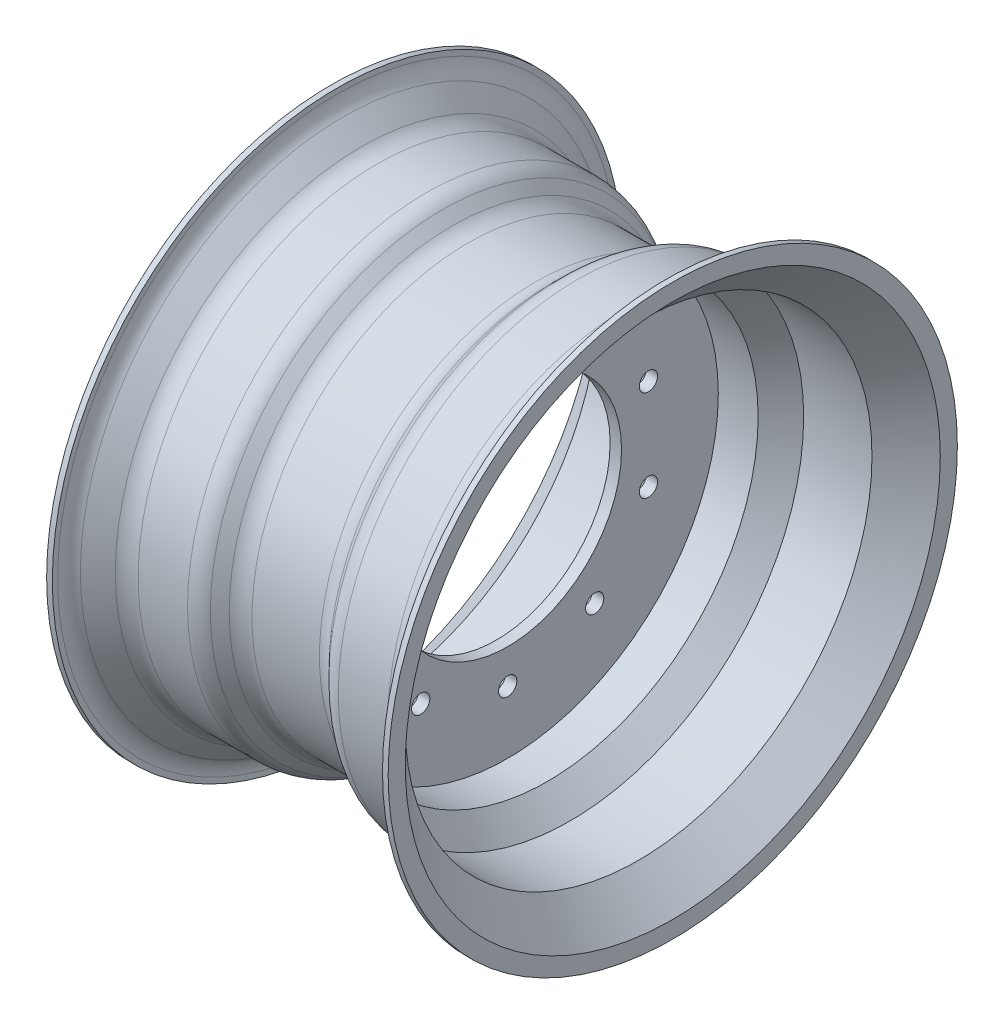
ISO-10303-21;
HEADER;
FILE_DESCRIPTION(('STEP AP214'),'2;1');
FILE_NAME('part.step','',(''),(''),'','','');
FILE_SCHEMA(('AUTOMOTIVE_DESIGN { 1 0 10303 214 1 1 1 1 }'));
ENDSEC;
DATA;
#1=APPLICATION_CONTEXT('core data for automotive mechanical design processes');
#2=APPLICATION_PROTOCOL_DEFINITION('international standard','automotive_design',2000,#1);
#3=PRODUCT_CONTEXT('',#1,'mechanical');
#4=PRODUCT('Part','Part','',(#3));
#5=PRODUCT_RELATED_PRODUCT_CATEGORY('part','',(#4));
#6=PRODUCT_DEFINITION_FORMATION('','',#4);
#7=PRODUCT_DEFINITION_CONTEXT('part definition',#1,'design');
#8=PRODUCT_DEFINITION('design','',#6,#7);
#9=PRODUCT_DEFINITION_SHAPE('','',#8);
#10=(LENGTH_UNIT() NAMED_UNIT(*) SI_UNIT(.MILLI.,.METRE.));
#11=(NAMED_UNIT(*) PLANE_ANGLE_UNIT() SI_UNIT($,.RADIAN.));
#12=(NAMED_UNIT(*) SI_UNIT($,.STERADIAN.) SOLID_ANGLE_UNIT());
#13=UNCERTAINTY_MEASURE_WITH_UNIT(LENGTH_MEASURE(1.E-05),#10,'distance_accuracy_value','');
#14=(GEOMETRIC_REPRESENTATION_CONTEXT(3) GLOBAL_UNCERTAINTY_ASSIGNED_CONTEXT((#13)) GLOBAL_UNIT_ASSIGNED_CONTEXT((#10,
#11,#12)) REPRESENTATION_CONTEXT('',''));
#15=CARTESIAN_POINT('',(0.,0.,0.));
#16=DIRECTION('',(0.,0.,1.));
#17=DIRECTION('',(1.,0.,0.));
#18=AXIS2_PLACEMENT_3D('',#15,#16,#17);
#19=CARTESIAN_POINT('',(0.,0.,0.));
#20=DIRECTION('',(1.,0.,0.));
#21=DIRECTION('',(0.,0.,-1.));
#22=AXIS2_PLACEMENT_3D('',#19,#20,#21);
#23=CYLINDRICAL_SURFACE('',#22,250.);
#24=CARTESIAN_POINT('',(-150.,0.,0.));
#25=DIRECTION('',(1.,0.,0.));
#26=DIRECTION('',(0.,0.,-1.));
#27=AXIS2_PLACEMENT_3D('',#24,#25,#26);
#28=CIRCLE('',#27,250.);
#29=CARTESIAN_POINT('',(-150.,0.,-250.));
#30=VERTEX_POINT('',#29);
#31=EDGE_CURVE('E169',#30,#30,#28,.T.);
#32=ORIENTED_EDGE('',*,*,#31,.T.);
#33=EDGE_LOOP('',(#32));
#34=FACE_BOUND('',#33,.T.);
#35=CARTESIAN_POINT('',(-145.,0.,0.));
#36=DIRECTION('',(1.,0.,0.));
#37=DIRECTION('',(0.,0.,-1.));
#38=AXIS2_PLACEMENT_3D('',#35,#36,#37);
#39=CIRCLE('',#38,250.);
#40=CARTESIAN_POINT('',(-145.,0.,-250.));
#41=VERTEX_POINT('',#40);
#42=EDGE_CURVE('E109',#41,#41,#39,.T.);
#43=ORIENTED_EDGE('',*,*,#42,.F.);
#44=EDGE_LOOP('',(#43));
#45=FACE_BOUND('',#44,.T.);
#46=ADVANCED_FACE('F37',(#34,#45),#23,.T.);
#47=CARTESIAN_POINT('',(-145.,250.,0.));
#48=DIRECTION('',(1.,0.,0.));
#49=DIRECTION('',(0.,0.,-1.));
#50=AXIS2_PLACEMENT_3D('',#47,#48,#49);
#51=PLANE('',#50);
#52=CARTESIAN_POINT('',(-145.,0.,0.));
#53=DIRECTION('',(1.,0.,0.));
#54=DIRECTION('',(0.,0.,-1.));
#55=AXIS2_PLACEMENT_3D('',#52,#53,#54);
#56=CIRCLE('',#55,245.355339059327);
#57=CARTESIAN_POINT('',(-145.,0.,-245.355339059327));
#58=VERTEX_POINT('',#57);
#59=EDGE_CURVE('E10',#58,#58,#56,.F.);
#60=ORIENTED_EDGE('',*,*,#59,.T.);
#61=EDGE_LOOP('',(#60));
#62=FACE_BOUND('',#61,.T.);
#63=ORIENTED_EDGE('',*,*,#42,.T.);
#64=EDGE_LOOP('',(#63));
#65=FACE_BOUND('',#64,.T.);
#66=ADVANCED_FACE('F324',(#62,#65),#51,.T.);
#67=CARTESIAN_POINT('',(-117.928932188135,0.,0.));
#68=DIRECTION('',(-1.,0.,0.));
#69=DIRECTION('',(0.,0.,1.));
#70=AXIS2_PLACEMENT_3D('',#67,#68,#69);
#71=CONICAL_SURFACE('',#70,210.,0.785398163397448);
#72=CARTESIAN_POINT('',(-123.786796564404,0.,0.));
#73=DIRECTION('',(-1.,0.,0.));
#74=DIRECTION('',(0.,0.,1.));
#75=AXIS2_PLACEMENT_3D('',#72,#73,#74);
#76=CIRCLE('',#75,215.857864376269);
#77=CARTESIAN_POINT('',(-123.786796564404,0.,215.857864376269));
#78=VERTEX_POINT('',#77);
#79=EDGE_CURVE('E45',#78,#78,#76,.T.);
#80=ORIENTED_EDGE('',*,*,#79,.T.);
#81=EDGE_LOOP('',(#80));
#82=FACE_BOUND('',#81,.T.);
#83=CARTESIAN_POINT('',(-139.142135623731,0.,0.));
#84=DIRECTION('',(-1.,0.,0.));
#85=DIRECTION('',(0.,0.,1.));
#86=AXIS2_PLACEMENT_3D('',#83,#84,#85);
#87=CIRCLE('',#86,231.213203435596);
#88=CARTESIAN_POINT('',(-139.142135623731,0.,231.213203435596));
#89=VERTEX_POINT('',#88);
#90=EDGE_CURVE('E50',#89,#89,#87,.F.);
#91=ORIENTED_EDGE('',*,*,#90,.T.);
#92=EDGE_LOOP('',(#91));
#93=FACE_BOUND('',#92,.T.);
#94=ADVANCED_FACE('F329',(#82,#93),#71,.T.);
#95=CARTESIAN_POINT('',(0.,0.,0.));
#96=DIRECTION('',(1.,0.,0.));
#97=DIRECTION('',(0.,0.,-1.));
#98=AXIS2_PLACEMENT_3D('',#95,#96,#97);
#99=CYLINDRICAL_SURFACE('',#98,210.);
#100=CARTESIAN_POINT('',(-66.2132034355965,0.,0.));
#101=DIRECTION('',(-1.,0.,0.));
#102=DIRECTION('',(0.,0.,1.));
#103=AXIS2_PLACEMENT_3D('',#100,#101,#102);
#104=CIRCLE('',#103,210.);
#105=CARTESIAN_POINT('',(-66.2132034355965,0.,210.));
#106=VERTEX_POINT('',#105);
#107=EDGE_CURVE('E55',#106,#106,#104,.T.);
#108=ORIENTED_EDGE('',*,*,#107,.T.);
#109=EDGE_LOOP('',(#108));
#110=FACE_BOUND('',#109,.T.);
#111=CARTESIAN_POINT('',(-109.644660940673,0.,0.));
#112=DIRECTION('',(1.,0.,0.));
#113=DIRECTION('',(0.,0.,-1.));
#114=AXIS2_PLACEMENT_3D('',#111,#112,#113);
#115=CIRCLE('',#114,210.);
#116=CARTESIAN_POINT('',(-109.644660940673,0.,-210.));
#117=VERTEX_POINT('',#116);
#118=EDGE_CURVE('E61',#117,#117,#115,.T.);
#119=ORIENTED_EDGE('',*,*,#118,.T.);
#120=EDGE_LOOP('',(#119));
#121=FACE_BOUND('',#120,.T.);
#122=ADVANCED_FACE('F334',(#110,#121),#99,.T.);
#123=CARTESIAN_POINT('',(-37.9289321881345,0.,0.));
#124=DIRECTION('',(-1.,0.,0.));
#125=DIRECTION('',(0.,0.,1.));
#126=AXIS2_PLACEMENT_3D('',#123,#124,#125);
#127=CONICAL_SURFACE('',#126,190.,0.785398163397448);
#128=CARTESIAN_POINT('',(-43.7867965644036,0.,0.));
#129=DIRECTION('',(-1.,0.,0.));
#130=DIRECTION('',(0.,0.,1.));
#131=AXIS2_PLACEMENT_3D('',#128,#129,#130);
#132=CIRCLE('',#131,195.857864376269);
#133=CARTESIAN_POINT('',(-43.7867965644036,0.,195.857864376269));
#134=VERTEX_POINT('',#133);
#135=EDGE_CURVE('E65',#134,#134,#132,.T.);
#136=ORIENTED_EDGE('',*,*,#135,.T.);
#137=EDGE_LOOP('',(#136));
#138=FACE_BOUND('',#137,.T.);
#139=CARTESIAN_POINT('',(-52.0710678118656,0.,0.));
#140=DIRECTION('',(1.,0.,0.));
#141=DIRECTION('',(0.,0.,-1.));
#142=AXIS2_PLACEMENT_3D('',#139,#140,#141);
#143=CIRCLE('',#142,204.142135623731);
#144=CARTESIAN_POINT('',(-52.0710678118656,0.,-204.142135623731));
#145=VERTEX_POINT('',#144);
#146=EDGE_CURVE('E69',#145,#145,#143,.T.);
#147=ORIENTED_EDGE('',*,*,#146,.T.);
#148=EDGE_LOOP('',(#147));
#149=FACE_BOUND('',#148,.T.);
#150=ADVANCED_FACE('F372',(#138,#149),#127,.T.);
#151=CARTESIAN_POINT('',(0.,0.,0.));
#152=DIRECTION('',(1.,0.,0.));
#153=DIRECTION('',(0.,0.,-1.));
#154=AXIS2_PLACEMENT_3D('',#151,#152,#153);
#155=CYLINDRICAL_SURFACE('',#154,190.);
#156=CARTESIAN_POINT('',(29.6446609406726,0.,0.));
#157=DIRECTION('',(1.,0.,0.));
#158=DIRECTION('',(0.,0.,-1.));
#159=AXIS2_PLACEMENT_3D('',#156,#157,#158);
#160=CIRCLE('',#159,190.);
#161=CARTESIAN_POINT('',(29.6446609406726,0.,-190.));
#162=VERTEX_POINT('',#161);
#163=EDGE_CURVE('E73',#162,#162,#160,.F.);
#164=ORIENTED_EDGE('',*,*,#163,.T.);
#165=EDGE_LOOP('',(#164));
#166=FACE_BOUND('',#165,.T.);
#167=CARTESIAN_POINT('',(-29.6446609406726,0.,0.));
#168=DIRECTION('',(1.,0.,0.));
#169=DIRECTION('',(0.,0.,-1.));
#170=AXIS2_PLACEMENT_3D('',#167,#168,#169);
#171=CIRCLE('',#170,190.);
#172=CARTESIAN_POINT('',(-29.6446609406726,0.,-190.));
#173=VERTEX_POINT('',#172);
#174=EDGE_CURVE('E77',#173,#173,#171,.T.);
#175=ORIENTED_EDGE('',*,*,#174,.T.);
#176=EDGE_LOOP('',(#175));
#177=FACE_BOUND('',#176,.T.);
#178=ADVANCED_FACE('F377',(#166,#177),#155,.T.);
#179=CARTESIAN_POINT('',(57.9289321881346,0.,0.));
#180=DIRECTION('',(1.,0.,0.));
#181=DIRECTION('',(0.,0.,-1.));
#182=AXIS2_PLACEMENT_3D('',#179,#180,#181);
#183=CONICAL_SURFACE('',#182,210.,0.785398163397448);
#184=CARTESIAN_POINT('',(52.0710678118656,0.,0.));
#185=DIRECTION('',(-1.,0.,0.));
#186=DIRECTION('',(0.,0.,1.));
#187=AXIS2_PLACEMENT_3D('',#184,#185,#186);
#188=CIRCLE('',#187,204.142135623731);
#189=CARTESIAN_POINT('',(52.0710678118656,0.,204.142135623731));
#190=VERTEX_POINT('',#189);
#191=EDGE_CURVE('E81',#190,#190,#188,.T.);
#192=ORIENTED_EDGE('',*,*,#191,.T.);
#193=EDGE_LOOP('',(#192));
#194=FACE_BOUND('',#193,.T.);
#195=CARTESIAN_POINT('',(43.7867965644036,0.,0.));
#196=DIRECTION('',(1.,0.,0.));
#197=DIRECTION('',(0.,0.,-1.));
#198=AXIS2_PLACEMENT_3D('',#195,#196,#197);
#199=CIRCLE('',#198,195.857864376269);
#200=CARTESIAN_POINT('',(43.7867965644036,0.,-195.857864376269));
#201=VERTEX_POINT('',#200);
#202=EDGE_CURVE('E85',#201,#201,#199,.T.);
#203=ORIENTED_EDGE('',*,*,#202,.T.);
#204=EDGE_LOOP('',(#203));
#205=FACE_BOUND('',#204,.T.);
#206=ADVANCED_FACE('F383',(#194,#205),#183,.T.);
#207=CARTESIAN_POINT('',(0.,0.,0.));
#208=DIRECTION('',(1.,0.,0.));
#209=DIRECTION('',(0.,0.,-1.));
#210=AXIS2_PLACEMENT_3D('',#207,#208,#209);
#211=CYLINDRICAL_SURFACE('',#210,210.);
#212=CARTESIAN_POINT('',(109.644660940673,0.,0.));
#213=DIRECTION('',(1.,0.,0.));
#214=DIRECTION('',(0.,0.,-1.));
#215=AXIS2_PLACEMENT_3D('',#212,#213,#214);
#216=CIRCLE('',#215,210.);
#217=CARTESIAN_POINT('',(109.644660940673,0.,-210.));
#218=VERTEX_POINT('',#217);
#219=EDGE_CURVE('E89',#218,#218,#216,.F.);
#220=ORIENTED_EDGE('',*,*,#219,.T.);
#221=EDGE_LOOP('',(#220));
#222=FACE_BOUND('',#221,.T.);
#223=CARTESIAN_POINT('',(66.2132034355965,0.,0.));
#224=DIRECTION('',(-1.,0.,0.));
#225=DIRECTION('',(0.,0.,1.));
#226=AXIS2_PLACEMENT_3D('',#223,#224,#225);
#227=CIRCLE('',#226,210.);
#228=CARTESIAN_POINT('',(66.2132034355965,0.,210.));
#229=VERTEX_POINT('',#228);
#230=EDGE_CURVE('E93',#229,#229,#227,.F.);
#231=ORIENTED_EDGE('',*,*,#230,.T.);
#232=EDGE_LOOP('',(#231));
#233=FACE_BOUND('',#232,.T.);
#234=ADVANCED_FACE('F387',(#222,#233),#211,.T.);
#235=CARTESIAN_POINT('',(145.,0.,0.));
#236=DIRECTION('',(1.,0.,0.));
#237=DIRECTION('',(0.,0.,-1.));
#238=AXIS2_PLACEMENT_3D('',#235,#236,#237);
#239=CONICAL_SURFACE('',#238,237.071067811865,0.785398163397448);
#240=CARTESIAN_POINT('',(139.142135623731,0.,0.));
#241=DIRECTION('',(1.,0.,0.));
#242=DIRECTION('',(0.,0.,-1.));
#243=AXIS2_PLACEMENT_3D('',#240,#241,#242);
#244=CIRCLE('',#243,231.213203435596);
#245=CARTESIAN_POINT('',(139.142135623731,0.,-231.213203435596));
#246=VERTEX_POINT('',#245);
#247=EDGE_CURVE('E97',#246,#246,#244,.F.);
#248=ORIENTED_EDGE('',*,*,#247,.T.);
#249=EDGE_LOOP('',(#248));
#250=FACE_BOUND('',#249,.T.);
#251=CARTESIAN_POINT('',(123.786796564404,0.,0.));
#252=DIRECTION('',(1.,0.,0.));
#253=DIRECTION('',(0.,0.,-1.));
#254=AXIS2_PLACEMENT_3D('',#251,#252,#253);
#255=CIRCLE('',#254,215.857864376269);
#256=CARTESIAN_POINT('',(123.786796564404,0.,-215.857864376269));
#257=VERTEX_POINT('',#256);
#258=EDGE_CURVE('E101',#257,#257,#255,.T.);
#259=ORIENTED_EDGE('',*,*,#258,.T.);
#260=EDGE_LOOP('',(#259));
#261=FACE_BOUND('',#260,.T.);
#262=ADVANCED_FACE('F391',(#250,#261),#239,.T.);
#263=CARTESIAN_POINT('',(145.,250.,0.));
#264=DIRECTION('',(-1.,0.,0.));
#265=DIRECTION('',(0.,0.,1.));
#266=AXIS2_PLACEMENT_3D('',#263,#264,#265);
#267=PLANE('',#266);
#268=CARTESIAN_POINT('',(145.,0.,0.));
#269=DIRECTION('',(-1.,0.,0.));
#270=DIRECTION('',(0.,0.,1.));
#271=AXIS2_PLACEMENT_3D('',#268,#269,#270);
#272=CIRCLE('',#271,245.355339059327);
#273=CARTESIAN_POINT('',(145.,0.,245.355339059327));
#274=VERTEX_POINT('',#273);
#275=EDGE_CURVE('E105',#274,#274,#272,.F.);
#276=ORIENTED_EDGE('',*,*,#275,.T.);
#277=EDGE_LOOP('',(#276));
#278=FACE_BOUND('',#277,.T.);
#279=CARTESIAN_POINT('',(145.,0.,0.));
#280=DIRECTION('',(1.,0.,0.));
#281=DIRECTION('',(0.,0.,-1.));
#282=AXIS2_PLACEMENT_3D('',#279,#280,#281);
#283=CIRCLE('',#282,250.);
#284=CARTESIAN_POINT('',(145.,0.,-250.));
#285=VERTEX_POINT('',#284);
#286=EDGE_CURVE('E113',#285,#285,#283,.T.);
#287=ORIENTED_EDGE('',*,*,#286,.F.);
#288=EDGE_LOOP('',(#287));
#289=FACE_BOUND('',#288,.T.);
#290=ADVANCED_FACE('F395',(#278,#289),#267,.T.);
#291=CARTESIAN_POINT('',(0.,0.,0.));
#292=DIRECTION('',(1.,0.,0.));
#293=DIRECTION('',(0.,0.,-1.));
#294=AXIS2_PLACEMENT_3D('',#291,#292,#293);
#295=CYLINDRICAL_SURFACE('',#294,250.);
#296=ORIENTED_EDGE('',*,*,#286,.T.);
#297=EDGE_LOOP('',(#296));
#298=FACE_BOUND('',#297,.T.);
#299=CARTESIAN_POINT('',(150.,0.,0.));
#300=DIRECTION('',(1.,0.,0.));
#301=DIRECTION('',(0.,0.,-1.));
#302=AXIS2_PLACEMENT_3D('',#299,#300,#301);
#303=CIRCLE('',#302,250.);
#304=CARTESIAN_POINT('',(150.,0.,-250.));
#305=VERTEX_POINT('',#304);
#306=EDGE_CURVE('E117',#305,#305,#303,.T.);
#307=ORIENTED_EDGE('',*,*,#306,.F.);
#308=EDGE_LOOP('',(#307));
#309=FACE_BOUND('',#308,.T.);
#310=ADVANCED_FACE('F399',(#298,#309),#295,.T.);
#311=CARTESIAN_POINT('',(150.,250.,0.));
#312=DIRECTION('',(1.,0.,0.));
#313=DIRECTION('',(0.,0.,-1.));
#314=AXIS2_PLACEMENT_3D('',#311,#312,#313);
#315=PLANE('',#314);
#316=ORIENTED_EDGE('',*,*,#306,.T.);
#317=EDGE_LOOP('',(#316));
#318=FACE_BOUND('',#317,.T.);
#319=CARTESIAN_POINT('',(150.,0.,0.));
#320=DIRECTION('',(1.,0.,0.));
#321=DIRECTION('',(0.,0.,-1.));
#322=AXIS2_PLACEMENT_3D('',#319,#320,#321);
#323=CIRCLE('',#322,235.);
#324=CARTESIAN_POINT('',(150.,0.,-235.));
#325=VERTEX_POINT('',#324);
#326=EDGE_CURVE('E121',#325,#325,#323,.T.);
#327=ORIENTED_EDGE('',*,*,#326,.F.);
#328=EDGE_LOOP('',(#327));
#329=FACE_BOUND('',#328,.T.);
#330=ADVANCED_FACE('F403',(#318,#329),#315,.T.);
#331=CARTESIAN_POINT('',(120.,0.,0.));
#332=DIRECTION('',(1.,0.,0.));
#333=DIRECTION('',(0.,0.,-1.));
#334=AXIS2_PLACEMENT_3D('',#331,#332,#333);
#335=CONICAL_SURFACE('',#334,205.,0.785398163397448);
#336=ORIENTED_EDGE('',*,*,#326,.T.);
#337=EDGE_LOOP('',(#336));
#338=FACE_BOUND('',#337,.T.);
#339=CARTESIAN_POINT('',(120.,0.,0.));
#340=DIRECTION('',(1.,0.,0.));
#341=DIRECTION('',(0.,0.,-1.));
#342=AXIS2_PLACEMENT_3D('',#339,#340,#341);
#343=CIRCLE('',#342,205.);
#344=CARTESIAN_POINT('',(120.,0.,-205.));
#345=VERTEX_POINT('',#344);
#346=EDGE_CURVE('E125',#345,#345,#343,.T.);
#347=ORIENTED_EDGE('',*,*,#346,.F.);
#348=EDGE_LOOP('',(#347));
#349=FACE_BOUND('',#348,.T.);
#350=ADVANCED_FACE('F407',(#338,#349),#335,.F.);
#351=CARTESIAN_POINT('',(0.,0.,0.));
#352=DIRECTION('',(1.,0.,0.));
#353=DIRECTION('',(0.,0.,-1.));
#354=AXIS2_PLACEMENT_3D('',#351,#352,#353);
#355=CYLINDRICAL_SURFACE('',#354,205.);
#356=ORIENTED_EDGE('',*,*,#346,.T.);
#357=EDGE_LOOP('',(#356));
#358=FACE_BOUND('',#357,.T.);
#359=CARTESIAN_POINT('',(60.0000000000001,0.,0.));
#360=DIRECTION('',(1.,0.,0.));
#361=DIRECTION('',(0.,0.,-1.));
#362=AXIS2_PLACEMENT_3D('',#359,#360,#361);
#363=CIRCLE('',#362,205.);
#364=CARTESIAN_POINT('',(60.0000000000001,0.,-205.));
#365=VERTEX_POINT('',#364);
#366=EDGE_CURVE('E129',#365,#365,#363,.T.);
#367=ORIENTED_EDGE('',*,*,#366,.F.);
#368=EDGE_LOOP('',(#367));
#369=FACE_BOUND('',#368,.T.);
#370=ADVANCED_FACE('F411',(#358,#369),#355,.F.);
#371=CARTESIAN_POINT('',(40.0000000000001,0.,0.));
#372=DIRECTION('',(1.,0.,0.));
#373=DIRECTION('',(0.,0.,-1.));
#374=AXIS2_PLACEMENT_3D('',#371,#372,#373);
#375=CONICAL_SURFACE('',#374,185.,0.78539816339745);
#376=ORIENTED_EDGE('',*,*,#366,.T.);
#377=EDGE_LOOP('',(#376));
#378=FACE_BOUND('',#377,.T.);
#379=CARTESIAN_POINT('',(40.0000000000001,0.,0.));
#380=DIRECTION('',(1.,0.,0.));
#381=DIRECTION('',(0.,0.,-1.));
#382=AXIS2_PLACEMENT_3D('',#379,#380,#381);
#383=CIRCLE('',#382,185.);
#384=CARTESIAN_POINT('',(40.0000000000001,0.,-185.));
#385=VERTEX_POINT('',#384);
#386=EDGE_CURVE('E133',#385,#385,#383,.T.);
#387=ORIENTED_EDGE('',*,*,#386,.F.);
#388=EDGE_LOOP('',(#387));
#389=FACE_BOUND('',#388,.T.);
#390=ADVANCED_FACE('F415',(#378,#389),#375,.F.);
#391=CARTESIAN_POINT('',(0.,0.,0.));
#392=DIRECTION('',(1.,0.,0.));
#393=DIRECTION('',(0.,0.,-1.));
#394=AXIS2_PLACEMENT_3D('',#391,#392,#393);
#395=CYLINDRICAL_SURFACE('',#394,185.);
#396=ORIENTED_EDGE('',*,*,#386,.T.);
#397=EDGE_LOOP('',(#396));
#398=FACE_BOUND('',#397,.T.);
#399=CARTESIAN_POINT('',(5.,0.,0.));
#400=DIRECTION('',(1.,0.,0.));
#401=DIRECTION('',(0.,0.,-1.));
#402=AXIS2_PLACEMENT_3D('',#399,#400,#401);
#403=CIRCLE('',#402,185.);
#404=CARTESIAN_POINT('',(5.,0.,-185.));
#405=VERTEX_POINT('',#404);
#406=EDGE_CURVE('E137',#405,#405,#403,.T.);
#407=ORIENTED_EDGE('',*,*,#406,.F.);
#408=EDGE_LOOP('',(#407));
#409=FACE_BOUND('',#408,.T.);
#410=ADVANCED_FACE('F269',(#398,#409),#395,.F.);
#411=CARTESIAN_POINT('',(5.00000000000001,185.,0.));
#412=DIRECTION('',(1.,0.,0.));
#413=DIRECTION('',(0.,0.,-1.));
#414=AXIS2_PLACEMENT_3D('',#411,#412,#413);
#415=PLANE('',#414);
#416=CARTESIAN_POINT('',(5.00000000000001,105.172209268744,76.4120827980201));
#417=DIRECTION('',(1.,0.,0.));
#418=DIRECTION('',(0.,0.587785252292462,-0.809016994374955));
#419=AXIS2_PLACEMENT_3D('',#416,#417,#418);
#420=CIRCLE('',#419,8.);
#421=CARTESIAN_POINT('',(5.00000000000001,109.874491287084,69.9399468430205));
#422=VERTEX_POINT('',#421);
#423=EDGE_CURVE('E190',#422,#422,#420,.T.);
#424=ORIENTED_EDGE('',*,*,#423,.F.);
#425=EDGE_LOOP('',(#424));
#426=FACE_BOUND('',#425,.T.);
#427=CARTESIAN_POINT('',(5.00000000000001,40.1722092687446,123.63734711837));
#428=DIRECTION('',(1.,0.,0.));
#429=DIRECTION('',(0.,0.95105651629515,-0.309016994374958));
#430=AXIS2_PLACEMENT_3D('',#427,#428,#429);
#431=CIRCLE('',#430,8.);
#432=CARTESIAN_POINT('',(5.00000000000001,47.7806613991058,121.16521116337));
#433=VERTEX_POINT('',#432);
#434=EDGE_CURVE('E198',#433,#433,#431,.T.);
#435=ORIENTED_EDGE('',*,*,#434,.F.);
#436=EDGE_LOOP('',(#435));
#437=FACE_BOUND('',#436,.T.);
#438=CARTESIAN_POINT('',(5.00000000000001,-40.172209268742,123.63734711837));
#439=DIRECTION('',(1.,0.,0.));
#440=DIRECTION('',(0.,0.951056516295157,0.309016994374938));
#441=AXIS2_PLACEMENT_3D('',#438,#439,#440);
#442=CIRCLE('',#441,8.);
#443=CARTESIAN_POINT('',(5.00000000000001,-32.5637571383807,126.10948307337));
#444=VERTEX_POINT('',#443);
#445=EDGE_CURVE('E206',#444,#444,#442,.T.);
#446=ORIENTED_EDGE('',*,*,#445,.F.);
#447=EDGE_LOOP('',(#446));
#448=FACE_BOUND('',#447,.T.);
#449=CARTESIAN_POINT('',(5.00000000000001,-105.172209268742,76.4120827980224));
#450=DIRECTION('',(1.,0.,0.));
#451=DIRECTION('',(0.,0.58778525229248,0.809016994374942));
#452=AXIS2_PLACEMENT_3D('',#449,#450,#451);
#453=CIRCLE('',#452,8.);
#454=CARTESIAN_POINT('',(5.00000000000001,-100.469927250403,82.884218753022));
#455=VERTEX_POINT('',#454);
#456=EDGE_CURVE('E214',#455,#455,#453,.T.);
#457=ORIENTED_EDGE('',*,*,#456,.F.);
#458=EDGE_LOOP('',(#457));
#459=FACE_BOUND('',#458,.T.);
#460=CARTESIAN_POINT('',(5.00000000000001,-130.,0.));
#461=DIRECTION('',(1.,0.,0.));
#462=DIRECTION('',(0.,0.,1.));
#463=AXIS2_PLACEMENT_3D('',#460,#461,#462);
#464=CIRCLE('',#463,8.);
#465=CARTESIAN_POINT('',(5.00000000000001,-130.,8.));
#466=VERTEX_POINT('',#465);
#467=EDGE_CURVE('E222',#466,#466,#464,.T.);
#468=ORIENTED_EDGE('',*,*,#467,.F.);
#469=EDGE_LOOP('',(#468));
#470=FACE_BOUND('',#469,.T.);
#471=CARTESIAN_POINT('',(5.00000000000001,-105.172209268744,-76.4120827980209));
#472=DIRECTION('',(1.,0.,0.));
#473=DIRECTION('',(0.,-0.587785252292469,0.809016994374951));
#474=AXIS2_PLACEMENT_3D('',#471,#472,#473);
#475=CIRCLE('',#474,8.);
#476=CARTESIAN_POINT('',(5.00000000000001,-109.874491287083,-69.9399468430213));
#477=VERTEX_POINT('',#476);
#478=EDGE_CURVE('E230',#477,#477,#475,.T.);
#479=ORIENTED_EDGE('',*,*,#478,.F.);
#480=EDGE_LOOP('',(#479));
#481=FACE_BOUND('',#480,.T.);
#482=CARTESIAN_POINT('',(5.00000000000001,-40.1722092687437,-123.63734711837));
#483=DIRECTION('',(1.,0.,0.));
#484=DIRECTION('',(0.,-0.951056516295152,0.309016994374952));
#485=AXIS2_PLACEMENT_3D('',#482,#483,#484);
#486=CIRCLE('',#485,8.);
#487=CARTESIAN_POINT('',(5.00000000000001,-47.7806613991049,-121.16521116337));
#488=VERTEX_POINT('',#487);
#489=EDGE_CURVE('E238',#488,#488,#486,.T.);
#490=ORIENTED_EDGE('',*,*,#489,.F.);
#491=EDGE_LOOP('',(#490));
#492=FACE_BOUND('',#491,.T.);
#493=CARTESIAN_POINT('',(5.00000000000001,40.1722092687428,-123.63734711837));
#494=DIRECTION('',(1.,0.,0.));
#495=DIRECTION('',(0.,-0.951056516295155,-0.309016994374945));
#496=AXIS2_PLACEMENT_3D('',#493,#494,#495);
#497=CIRCLE('',#496,8.);
#498=CARTESIAN_POINT('',(5.00000000000001,32.5637571383816,-126.10948307337));
#499=VERTEX_POINT('',#498);
#500=EDGE_CURVE('E246',#499,#499,#497,.T.);
#501=ORIENTED_EDGE('',*,*,#500,.F.);
#502=EDGE_LOOP('',(#501));
#503=FACE_BOUND('',#502,.T.);
#504=CARTESIAN_POINT('',(5.00000000000001,105.172209268743,-76.4120827980217));
#505=DIRECTION('',(1.,0.,0.));
#506=DIRECTION('',(0.,-0.587785252292474,-0.809016994374947));
#507=AXIS2_PLACEMENT_3D('',#504,#505,#506);
#508=CIRCLE('',#507,8.);
#509=CARTESIAN_POINT('',(5.00000000000001,100.469927250403,-82.8842187530213));
#510=VERTEX_POINT('',#509);
#511=EDGE_CURVE('E182',#510,#510,#508,.T.);
#512=ORIENTED_EDGE('',*,*,#511,.F.);
#513=EDGE_LOOP('',(#512));
#514=FACE_BOUND('',#513,.T.);
#515=CARTESIAN_POINT('',(5.00000000000001,130.,0.));
#516=DIRECTION('',(1.,0.,0.));
#517=DIRECTION('',(0.,0.,-1.));
#518=AXIS2_PLACEMENT_3D('',#515,#516,#517);
#519=CIRCLE('',#518,8.);
#520=CARTESIAN_POINT('',(5.00000000000001,130.,-8.));
#521=VERTEX_POINT('',#520);
#522=EDGE_CURVE('E174',#521,#521,#519,.T.);
#523=ORIENTED_EDGE('',*,*,#522,.F.);
#524=EDGE_LOOP('',(#523));
#525=FACE_BOUND('',#524,.T.);
#526=ORIENTED_EDGE('',*,*,#406,.T.);
#527=EDGE_LOOP('',(#526));
#528=FACE_BOUND('',#527,.T.);
#529=CARTESIAN_POINT('',(5.00000000000002,0.,0.));
#530=DIRECTION('',(1.,0.,0.));
#531=DIRECTION('',(0.,0.,-1.));
#532=AXIS2_PLACEMENT_3D('',#529,#530,#531);
#533=CIRCLE('',#532,100.);
#534=CARTESIAN_POINT('',(5.00000000000002,0.,-100.));
#535=VERTEX_POINT('',#534);
#536=EDGE_CURVE('E141',#535,#535,#533,.T.);
#537=ORIENTED_EDGE('',*,*,#536,.F.);
#538=EDGE_LOOP('',(#537));
#539=FACE_BOUND('',#538,.T.);
#540=ADVANCED_FACE('F265',(#426,#437,#448,#459,#470,#481,#492,#503,#514,#525,#528,#539),#415,.T.);
#541=CARTESIAN_POINT('',(0.,0.,0.));
#542=DIRECTION('',(1.,0.,0.));
#543=DIRECTION('',(0.,0.,-1.));
#544=AXIS2_PLACEMENT_3D('',#541,#542,#543);
#545=CYLINDRICAL_SURFACE('',#544,100.);
#546=ORIENTED_EDGE('',*,*,#536,.T.);
#547=EDGE_LOOP('',(#546));
#548=FACE_BOUND('',#547,.T.);
#549=CARTESIAN_POINT('',(-4.99999999999998,0.,0.));
#550=DIRECTION('',(1.,0.,0.));
#551=DIRECTION('',(0.,0.,-1.));
#552=AXIS2_PLACEMENT_3D('',#549,#550,#551);
#553=CIRCLE('',#552,100.);
#554=CARTESIAN_POINT('',(-4.99999999999998,0.,-100.));
#555=VERTEX_POINT('',#554);
#556=EDGE_CURVE('E145',#555,#555,#553,.T.);
#557=ORIENTED_EDGE('',*,*,#556,.F.);
#558=EDGE_LOOP('',(#557));
#559=FACE_BOUND('',#558,.T.);
#560=ADVANCED_FACE('F268',(#548,#559),#545,.F.);
#561=CARTESIAN_POINT('',(-4.99999999999999,185.,0.));
#562=DIRECTION('',(-1.,0.,0.));
#563=DIRECTION('',(0.,0.,1.));
#564=AXIS2_PLACEMENT_3D('',#561,#562,#563);
#565=PLANE('',#564);
#566=CARTESIAN_POINT('',(-4.99999999999999,105.172209268744,76.4120827980201));
#567=DIRECTION('',(1.,0.,0.));
#568=DIRECTION('',(0.,0.587785252292462,-0.809016994374955));
#569=AXIS2_PLACEMENT_3D('',#566,#567,#568);
#570=CIRCLE('',#569,8.);
#571=CARTESIAN_POINT('',(-4.99999999999999,109.874491287084,69.9399468430205));
#572=VERTEX_POINT('',#571);
#573=EDGE_CURVE('E194',#572,#572,#570,.T.);
#574=ORIENTED_EDGE('',*,*,#573,.T.);
#575=EDGE_LOOP('',(#574));
#576=FACE_BOUND('',#575,.T.);
#577=CARTESIAN_POINT('',(-4.99999999999999,40.1722092687446,123.63734711837));
#578=DIRECTION('',(1.,0.,0.));
#579=DIRECTION('',(0.,0.95105651629515,-0.309016994374958));
#580=AXIS2_PLACEMENT_3D('',#577,#578,#579);
#581=CIRCLE('',#580,8.);
#582=CARTESIAN_POINT('',(-4.99999999999999,47.7806613991058,121.16521116337));
#583=VERTEX_POINT('',#582);
#584=EDGE_CURVE('E202',#583,#583,#581,.T.);
#585=ORIENTED_EDGE('',*,*,#584,.T.);
#586=EDGE_LOOP('',(#585));
#587=FACE_BOUND('',#586,.T.);
#588=CARTESIAN_POINT('',(-4.99999999999999,-40.172209268742,123.63734711837));
#589=DIRECTION('',(1.,0.,0.));
#590=DIRECTION('',(0.,0.951056516295157,0.309016994374938));
#591=AXIS2_PLACEMENT_3D('',#588,#589,#590);
#592=CIRCLE('',#591,8.);
#593=CARTESIAN_POINT('',(-4.99999999999999,-32.5637571383807,126.10948307337));
#594=VERTEX_POINT('',#593);
#595=EDGE_CURVE('E210',#594,#594,#592,.T.);
#596=ORIENTED_EDGE('',*,*,#595,.T.);
#597=EDGE_LOOP('',(#596));
#598=FACE_BOUND('',#597,.T.);
#599=CARTESIAN_POINT('',(-4.99999999999999,-105.172209268742,76.4120827980224));
#600=DIRECTION('',(1.,0.,0.));
#601=DIRECTION('',(0.,0.58778525229248,0.809016994374942));
#602=AXIS2_PLACEMENT_3D('',#599,#600,#601);
#603=CIRCLE('',#602,8.);
#604=CARTESIAN_POINT('',(-4.99999999999999,-100.469927250403,82.884218753022));
#605=VERTEX_POINT('',#604);
#606=EDGE_CURVE('E218',#605,#605,#603,.T.);
#607=ORIENTED_EDGE('',*,*,#606,.T.);
#608=EDGE_LOOP('',(#607));
#609=FACE_BOUND('',#608,.T.);
#610=CARTESIAN_POINT('',(-4.99999999999999,-130.,0.));
#611=DIRECTION('',(1.,0.,0.));
#612=DIRECTION('',(0.,0.,1.));
#613=AXIS2_PLACEMENT_3D('',#610,#611,#612);
#614=CIRCLE('',#613,8.);
#615=CARTESIAN_POINT('',(-4.99999999999999,-130.,8.));
#616=VERTEX_POINT('',#615);
#617=EDGE_CURVE('E226',#616,#616,#614,.T.);
#618=ORIENTED_EDGE('',*,*,#617,.T.);
#619=EDGE_LOOP('',(#618));
#620=FACE_BOUND('',#619,.T.);
#621=CARTESIAN_POINT('',(-4.99999999999999,-105.172209268744,-76.4120827980209));
#622=DIRECTION('',(1.,0.,0.));
#623=DIRECTION('',(0.,-0.587785252292469,0.809016994374951));
#624=AXIS2_PLACEMENT_3D('',#621,#622,#623);
#625=CIRCLE('',#624,8.);
#626=CARTESIAN_POINT('',(-4.99999999999999,-109.874491287083,-69.9399468430213));
#627=VERTEX_POINT('',#626);
#628=EDGE_CURVE('E234',#627,#627,#625,.T.);
#629=ORIENTED_EDGE('',*,*,#628,.T.);
#630=EDGE_LOOP('',(#629));
#631=FACE_BOUND('',#630,.T.);
#632=CARTESIAN_POINT('',(-4.99999999999999,-40.1722092687437,-123.63734711837));
#633=DIRECTION('',(1.,0.,0.));
#634=DIRECTION('',(0.,-0.951056516295152,0.309016994374952));
#635=AXIS2_PLACEMENT_3D('',#632,#633,#634);
#636=CIRCLE('',#635,8.);
#637=CARTESIAN_POINT('',(-4.99999999999999,-47.7806613991049,-121.16521116337));
#638=VERTEX_POINT('',#637);
#639=EDGE_CURVE('E242',#638,#638,#636,.T.);
#640=ORIENTED_EDGE('',*,*,#639,.T.);
#641=EDGE_LOOP('',(#640));
#642=FACE_BOUND('',#641,.T.);
#643=CARTESIAN_POINT('',(-4.99999999999999,40.1722092687428,-123.63734711837));
#644=DIRECTION('',(1.,0.,0.));
#645=DIRECTION('',(0.,-0.951056516295155,-0.309016994374945));
#646=AXIS2_PLACEMENT_3D('',#643,#644,#645);
#647=CIRCLE('',#646,8.);
#648=CARTESIAN_POINT('',(-4.99999999999999,32.5637571383816,-126.10948307337));
#649=VERTEX_POINT('',#648);
#650=EDGE_CURVE('E186',#649,#649,#647,.T.);
#651=ORIENTED_EDGE('',*,*,#650,.T.);
#652=EDGE_LOOP('',(#651));
#653=FACE_BOUND('',#652,.T.);
#654=CARTESIAN_POINT('',(-4.99999999999999,105.172209268743,-76.4120827980217));
#655=DIRECTION('',(1.,0.,0.));
#656=DIRECTION('',(0.,-0.587785252292474,-0.809016994374947));
#657=AXIS2_PLACEMENT_3D('',#654,#655,#656);
#658=CIRCLE('',#657,8.);
#659=CARTESIAN_POINT('',(-4.99999999999999,100.469927250403,-82.8842187530213));
#660=VERTEX_POINT('',#659);
#661=EDGE_CURVE('E178',#660,#660,#658,.T.);
#662=ORIENTED_EDGE('',*,*,#661,.T.);
#663=EDGE_LOOP('',(#662));
#664=FACE_BOUND('',#663,.T.);
#665=CARTESIAN_POINT('',(-4.99999999999999,130.,0.));
#666=DIRECTION('',(1.,0.,0.));
#667=DIRECTION('',(0.,0.,-1.));
#668=AXIS2_PLACEMENT_3D('',#665,#666,#667);
#669=CIRCLE('',#668,8.);
#670=CARTESIAN_POINT('',(-4.99999999999999,130.,-8.));
#671=VERTEX_POINT('',#670);
#672=EDGE_CURVE('E173',#671,#671,#669,.T.);
#673=ORIENTED_EDGE('',*,*,#672,.T.);
#674=EDGE_LOOP('',(#673));
#675=FACE_BOUND('',#674,.T.);
#676=ORIENTED_EDGE('',*,*,#556,.T.);
#677=EDGE_LOOP('',(#676));
#678=FACE_BOUND('',#677,.T.);
#679=CARTESIAN_POINT('',(-4.99999999999999,0.,0.));
#680=DIRECTION('',(1.,0.,0.));
#681=DIRECTION('',(0.,0.,-1.));
#682=AXIS2_PLACEMENT_3D('',#679,#680,#681);
#683=CIRCLE('',#682,185.);
#684=CARTESIAN_POINT('',(-4.99999999999999,0.,-185.));
#685=VERTEX_POINT('',#684);
#686=EDGE_CURVE('E149',#685,#685,#683,.T.);
#687=ORIENTED_EDGE('',*,*,#686,.F.);
#688=EDGE_LOOP('',(#687));
#689=FACE_BOUND('',#688,.T.);
#690=ADVANCED_FACE('F254',(#576,#587,#598,#609,#620,#631,#642,#653,#664,#675,#678,#689),#565,.T.);
#691=CARTESIAN_POINT('',(0.,0.,0.));
#692=DIRECTION('',(1.,0.,0.));
#693=DIRECTION('',(0.,0.,-1.));
#694=AXIS2_PLACEMENT_3D('',#691,#692,#693);
#695=CYLINDRICAL_SURFACE('',#694,185.);
#696=ORIENTED_EDGE('',*,*,#686,.T.);
#697=EDGE_LOOP('',(#696));
#698=FACE_BOUND('',#697,.T.);
#699=CARTESIAN_POINT('',(-40.0000000000001,0.,0.));
#700=DIRECTION('',(1.,0.,0.));
#701=DIRECTION('',(0.,0.,-1.));
#702=AXIS2_PLACEMENT_3D('',#699,#700,#701);
#703=CIRCLE('',#702,185.);
#704=CARTESIAN_POINT('',(-40.0000000000001,0.,-185.));
#705=VERTEX_POINT('',#704);
#706=EDGE_CURVE('E153',#705,#705,#703,.T.);
#707=ORIENTED_EDGE('',*,*,#706,.F.);
#708=EDGE_LOOP('',(#707));
#709=FACE_BOUND('',#708,.T.);
#710=ADVANCED_FACE('F287',(#698,#709),#695,.F.);
#711=CARTESIAN_POINT('',(-60.0000000000001,0.,0.));
#712=DIRECTION('',(-1.,0.,0.));
#713=DIRECTION('',(0.,0.,1.));
#714=AXIS2_PLACEMENT_3D('',#711,#712,#713);
#715=CONICAL_SURFACE('',#714,205.,0.78539816339745);
#716=ORIENTED_EDGE('',*,*,#706,.T.);
#717=EDGE_LOOP('',(#716));
#718=FACE_BOUND('',#717,.T.);
#719=CARTESIAN_POINT('',(-60.0000000000001,0.,0.));
#720=DIRECTION('',(1.,0.,0.));
#721=DIRECTION('',(0.,0.,-1.));
#722=AXIS2_PLACEMENT_3D('',#719,#720,#721);
#723=CIRCLE('',#722,205.);
#724=CARTESIAN_POINT('',(-60.0000000000001,0.,-205.));
#725=VERTEX_POINT('',#724);
#726=EDGE_CURVE('E157',#725,#725,#723,.T.);
#727=ORIENTED_EDGE('',*,*,#726,.F.);
#728=EDGE_LOOP('',(#727));
#729=FACE_BOUND('',#728,.T.);
#730=ADVANCED_FACE('F294',(#718,#729),#715,.F.);
#731=CARTESIAN_POINT('',(0.,0.,0.));
#732=DIRECTION('',(1.,0.,0.));
#733=DIRECTION('',(0.,0.,-1.));
#734=AXIS2_PLACEMENT_3D('',#731,#732,#733);
#735=CYLINDRICAL_SURFACE('',#734,205.);
#736=ORIENTED_EDGE('',*,*,#726,.T.);
#737=EDGE_LOOP('',(#736));
#738=FACE_BOUND('',#737,.T.);
#739=CARTESIAN_POINT('',(-120.,0.,0.));
#740=DIRECTION('',(1.,0.,0.));
#741=DIRECTION('',(0.,0.,-1.));
#742=AXIS2_PLACEMENT_3D('',#739,#740,#741);
#743=CIRCLE('',#742,205.);
#744=CARTESIAN_POINT('',(-120.,0.,-205.));
#745=VERTEX_POINT('',#744);
#746=EDGE_CURVE('E161',#745,#745,#743,.T.);
#747=ORIENTED_EDGE('',*,*,#746,.F.);
#748=EDGE_LOOP('',(#747));
#749=FACE_BOUND('',#748,.T.);
#750=ADVANCED_FACE('F300',(#738,#749),#735,.F.);
#751=CARTESIAN_POINT('',(-150.,0.,0.));
#752=DIRECTION('',(-1.,0.,0.));
#753=DIRECTION('',(0.,0.,1.));
#754=AXIS2_PLACEMENT_3D('',#751,#752,#753);
#755=CONICAL_SURFACE('',#754,235.,0.785398163397448);
#756=ORIENTED_EDGE('',*,*,#746,.T.);
#757=EDGE_LOOP('',(#756));
#758=FACE_BOUND('',#757,.T.);
#759=CARTESIAN_POINT('',(-150.,0.,0.));
#760=DIRECTION('',(1.,0.,0.));
#761=DIRECTION('',(0.,0.,-1.));
#762=AXIS2_PLACEMENT_3D('',#759,#760,#761);
#763=CIRCLE('',#762,235.);
#764=CARTESIAN_POINT('',(-150.,0.,-235.));
#765=VERTEX_POINT('',#764);
#766=EDGE_CURVE('E165',#765,#765,#763,.T.);
#767=ORIENTED_EDGE('',*,*,#766,.F.);
#768=EDGE_LOOP('',(#767));
#769=FACE_BOUND('',#768,.T.);
#770=ADVANCED_FACE('F306',(#758,#769),#755,.F.);
#771=CARTESIAN_POINT('',(-150.,250.,0.));
#772=DIRECTION('',(-1.,0.,0.));
#773=DIRECTION('',(0.,0.,1.));
#774=AXIS2_PLACEMENT_3D('',#771,#772,#773);
#775=PLANE('',#774);
#776=ORIENTED_EDGE('',*,*,#766,.T.);
#777=EDGE_LOOP('',(#776));
#778=FACE_BOUND('',#777,.T.);
#779=ORIENTED_EDGE('',*,*,#31,.F.);
#780=EDGE_LOOP('',(#779));
#781=FACE_BOUND('',#780,.T.);
#782=ADVANCED_FACE('F312',(#778,#781),#775,.T.);
#783=CARTESIAN_POINT('',(125.,0.,0.));
#784=DIRECTION('',(-1.,0.,0.));
#785=DIRECTION('',(0.,0.,1.));
#786=AXIS2_PLACEMENT_3D('',#783,#784,#785);
#787=TOROIDAL_SURFACE('',#786,245.355339059327,20.);
#788=ORIENTED_EDGE('',*,*,#247,.F.);
#789=EDGE_LOOP('',(#788));
#790=FACE_BOUND('',#789,.T.);
#791=ORIENTED_EDGE('',*,*,#275,.F.);
#792=EDGE_LOOP('',(#791));
#793=FACE_BOUND('',#792,.T.);
#794=ADVANCED_FACE('F318',(#790,#793),#787,.F.);
#795=CARTESIAN_POINT('',(109.644660940673,0.,0.));
#796=DIRECTION('',(1.,0.,0.));
#797=DIRECTION('',(0.,0.,-1.));
#798=AXIS2_PLACEMENT_3D('',#795,#796,#797);
#799=TOROIDAL_SURFACE('',#798,230.,20.);
#800=ORIENTED_EDGE('',*,*,#219,.F.);
#801=EDGE_LOOP('',(#800));
#802=FACE_BOUND('',#801,.T.);
#803=ORIENTED_EDGE('',*,*,#258,.F.);
#804=EDGE_LOOP('',(#803));
#805=FACE_BOUND('',#804,.T.);
#806=ADVANCED_FACE('F340',(#802,#805),#799,.F.);
#807=CARTESIAN_POINT('',(66.2132034355965,0.,0.));
#808=DIRECTION('',(-1.,0.,0.));
#809=DIRECTION('',(0.,0.,1.));
#810=AXIS2_PLACEMENT_3D('',#807,#808,#809);
#811=TOROIDAL_SURFACE('',#810,190.,20.);
#812=ORIENTED_EDGE('',*,*,#191,.F.);
#813=EDGE_LOOP('',(#812));
#814=FACE_BOUND('',#813,.T.);
#815=ORIENTED_EDGE('',*,*,#230,.F.);
#816=EDGE_LOOP('',(#815));
#817=FACE_BOUND('',#816,.T.);
#818=ADVANCED_FACE('F344',(#814,#817),#811,.T.);
#819=CARTESIAN_POINT('',(29.6446609406726,0.,0.));
#820=DIRECTION('',(1.,0.,0.));
#821=DIRECTION('',(0.,0.,-1.));
#822=AXIS2_PLACEMENT_3D('',#819,#820,#821);
#823=TOROIDAL_SURFACE('',#822,210.,20.);
#824=ORIENTED_EDGE('',*,*,#163,.F.);
#825=EDGE_LOOP('',(#824));
#826=FACE_BOUND('',#825,.T.);
#827=ORIENTED_EDGE('',*,*,#202,.F.);
#828=EDGE_LOOP('',(#827));
#829=FACE_BOUND('',#828,.T.);
#830=ADVANCED_FACE('F348',(#826,#829),#823,.F.);
#831=CARTESIAN_POINT('',(-29.6446609406726,0.,0.));
#832=DIRECTION('',(1.,0.,0.));
#833=DIRECTION('',(0.,0.,-1.));
#834=AXIS2_PLACEMENT_3D('',#831,#832,#833);
#835=TOROIDAL_SURFACE('',#834,210.,20.);
#836=ORIENTED_EDGE('',*,*,#135,.F.);
#837=EDGE_LOOP('',(#836));
#838=FACE_BOUND('',#837,.T.);
#839=ORIENTED_EDGE('',*,*,#174,.F.);
#840=EDGE_LOOP('',(#839));
#841=FACE_BOUND('',#840,.T.);
#842=ADVANCED_FACE('F352',(#838,#841),#835,.F.);
#843=CARTESIAN_POINT('',(-66.2132034355965,0.,0.));
#844=DIRECTION('',(-1.,0.,0.));
#845=DIRECTION('',(0.,0.,1.));
#846=AXIS2_PLACEMENT_3D('',#843,#844,#845);
#847=TOROIDAL_SURFACE('',#846,190.,20.);
#848=ORIENTED_EDGE('',*,*,#107,.F.);
#849=EDGE_LOOP('',(#848));
#850=FACE_BOUND('',#849,.T.);
#851=ORIENTED_EDGE('',*,*,#146,.F.);
#852=EDGE_LOOP('',(#851));
#853=FACE_BOUND('',#852,.T.);
#854=ADVANCED_FACE('F356',(#850,#853),#847,.T.);
#855=CARTESIAN_POINT('',(-109.644660940673,0.,0.));
#856=DIRECTION('',(1.,0.,0.));
#857=DIRECTION('',(0.,0.,-1.));
#858=AXIS2_PLACEMENT_3D('',#855,#856,#857);
#859=TOROIDAL_SURFACE('',#858,230.,20.);
#860=ORIENTED_EDGE('',*,*,#79,.F.);
#861=EDGE_LOOP('',(#860));
#862=FACE_BOUND('',#861,.T.);
#863=ORIENTED_EDGE('',*,*,#118,.F.);
#864=EDGE_LOOP('',(#863));
#865=FACE_BOUND('',#864,.T.);
#866=ADVANCED_FACE('F359',(#862,#865),#859,.F.);
#867=CARTESIAN_POINT('',(-125.,0.,0.));
#868=DIRECTION('',(1.,0.,0.));
#869=DIRECTION('',(0.,0.,-1.));
#870=AXIS2_PLACEMENT_3D('',#867,#868,#869);
#871=TOROIDAL_SURFACE('',#870,245.355339059327,20.);
#872=ORIENTED_EDGE('',*,*,#59,.F.);
#873=EDGE_LOOP('',(#872));
#874=FACE_BOUND('',#873,.T.);
#875=ORIENTED_EDGE('',*,*,#90,.F.);
#876=EDGE_LOOP('',(#875));
#877=FACE_BOUND('',#876,.T.);
#878=ADVANCED_FACE('F39',(#874,#877),#871,.F.);
#879=CARTESIAN_POINT('',(-4.99999999999999,130.,0.));
#880=DIRECTION('',(1.,0.,0.));
#881=DIRECTION('',(0.,0.,-1.));
#882=AXIS2_PLACEMENT_3D('',#879,#880,#881);
#883=CYLINDRICAL_SURFACE('',#882,8.);
#884=ORIENTED_EDGE('',*,*,#672,.F.);
#885=EDGE_LOOP('',(#884));
#886=FACE_BOUND('',#885,.T.);
#887=ORIENTED_EDGE('',*,*,#522,.T.);
#888=EDGE_LOOP('',(#887));
#889=FACE_BOUND('',#888,.T.);
#890=ADVANCED_FACE('F366',(#886,#889),#883,.F.);
#891=CARTESIAN_POINT('',(-4.99999999999999,105.172209268743,-76.4120827980217));
#892=DIRECTION('',(1.,0.,0.));
#893=DIRECTION('',(0.,0.,-1.));
#894=AXIS2_PLACEMENT_3D('',#891,#892,#893);
#895=CYLINDRICAL_SURFACE('',#894,8.);
#896=ORIENTED_EDGE('',*,*,#661,.F.);
#897=EDGE_LOOP('',(#896));
#898=FACE_BOUND('',#897,.T.);
#899=ORIENTED_EDGE('',*,*,#511,.T.);
#900=EDGE_LOOP('',(#899));
#901=FACE_BOUND('',#900,.T.);
#902=ADVANCED_FACE('F261',(#898,#901),#895,.F.);
#903=CARTESIAN_POINT('',(-4.99999999999999,40.1722092687428,-123.63734711837));
#904=DIRECTION('',(1.,0.,0.));
#905=DIRECTION('',(0.,0.,-1.));
#906=AXIS2_PLACEMENT_3D('',#903,#904,#905);
#907=CYLINDRICAL_SURFACE('',#906,8.);
#908=ORIENTED_EDGE('',*,*,#650,.F.);
#909=EDGE_LOOP('',(#908));
#910=FACE_BOUND('',#909,.T.);
#911=ORIENTED_EDGE('',*,*,#500,.T.);
#912=EDGE_LOOP('',(#911));
#913=FACE_BOUND('',#912,.T.);
#914=ADVANCED_FACE('F257',(#910,#913),#907,.F.);
#915=CARTESIAN_POINT('',(-4.99999999999999,-40.1722092687437,-123.63734711837));
#916=DIRECTION('',(1.,0.,0.));
#917=DIRECTION('',(0.,0.,-1.));
#918=AXIS2_PLACEMENT_3D('',#915,#916,#917);
#919=CYLINDRICAL_SURFACE('',#918,8.);
#920=ORIENTED_EDGE('',*,*,#639,.F.);
#921=EDGE_LOOP('',(#920));
#922=FACE_BOUND('',#921,.T.);
#923=ORIENTED_EDGE('',*,*,#489,.T.);
#924=EDGE_LOOP('',(#923));
#925=FACE_BOUND('',#924,.T.);
#926=ADVANCED_FACE('F260',(#922,#925),#919,.F.);
#927=CARTESIAN_POINT('',(-4.99999999999999,-105.172209268744,-76.4120827980209));
#928=DIRECTION('',(1.,0.,0.));
#929=DIRECTION('',(0.,0.,-1.));
#930=AXIS2_PLACEMENT_3D('',#927,#928,#929);
#931=CYLINDRICAL_SURFACE('',#930,8.);
#932=ORIENTED_EDGE('',*,*,#628,.F.);
#933=EDGE_LOOP('',(#932));
#934=FACE_BOUND('',#933,.T.);
#935=ORIENTED_EDGE('',*,*,#478,.T.);
#936=EDGE_LOOP('',(#935));
#937=FACE_BOUND('',#936,.T.);
#938=ADVANCED_FACE('F448',(#934,#937),#931,.F.);
#939=CARTESIAN_POINT('',(-4.99999999999999,-130.,0.));
#940=DIRECTION('',(1.,0.,0.));
#941=DIRECTION('',(0.,0.,-1.));
#942=AXIS2_PLACEMENT_3D('',#939,#940,#941);
#943=CYLINDRICAL_SURFACE('',#942,8.);
#944=ORIENTED_EDGE('',*,*,#617,.F.);
#945=EDGE_LOOP('',(#944));
#946=FACE_BOUND('',#945,.T.);
#947=ORIENTED_EDGE('',*,*,#467,.T.);
#948=EDGE_LOOP('',(#947));
#949=FACE_BOUND('',#948,.T.);
#950=ADVANCED_FACE('F444',(#946,#949),#943,.F.);
#951=CARTESIAN_POINT('',(-4.99999999999999,-105.172209268742,76.4120827980224));
#952=DIRECTION('',(1.,0.,0.));
#953=DIRECTION('',(0.,0.,-1.));
#954=AXIS2_PLACEMENT_3D('',#951,#952,#953);
#955=CYLINDRICAL_SURFACE('',#954,8.);
#956=ORIENTED_EDGE('',*,*,#606,.F.);
#957=EDGE_LOOP('',(#956));
#958=FACE_BOUND('',#957,.T.);
#959=ORIENTED_EDGE('',*,*,#456,.T.);
#960=EDGE_LOOP('',(#959));
#961=FACE_BOUND('',#960,.T.);
#962=ADVANCED_FACE('F440',(#958,#961),#955,.F.);
#963=CARTESIAN_POINT('',(-4.99999999999999,-40.172209268742,123.63734711837));
#964=DIRECTION('',(1.,0.,0.));
#965=DIRECTION('',(0.,0.,-1.));
#966=AXIS2_PLACEMENT_3D('',#963,#964,#965);
#967=CYLINDRICAL_SURFACE('',#966,8.);
#968=ORIENTED_EDGE('',*,*,#595,.F.);
#969=EDGE_LOOP('',(#968));
#970=FACE_BOUND('',#969,.T.);
#971=ORIENTED_EDGE('',*,*,#445,.T.);
#972=EDGE_LOOP('',(#971));
#973=FACE_BOUND('',#972,.T.);
#974=ADVANCED_FACE('F436',(#970,#973),#967,.F.);
#975=CARTESIAN_POINT('',(-4.99999999999999,40.1722092687446,123.63734711837));
#976=DIRECTION('',(1.,0.,0.));
#977=DIRECTION('',(0.,0.,-1.));
#978=AXIS2_PLACEMENT_3D('',#975,#976,#977);
#979=CYLINDRICAL_SURFACE('',#978,8.);
#980=ORIENTED_EDGE('',*,*,#584,.F.);
#981=EDGE_LOOP('',(#980));
#982=FACE_BOUND('',#981,.T.);
#983=ORIENTED_EDGE('',*,*,#434,.T.);
#984=EDGE_LOOP('',(#983));
#985=FACE_BOUND('',#984,.T.);
#986=ADVANCED_FACE('F432',(#982,#985),#979,.F.);
#987=CARTESIAN_POINT('',(-4.99999999999999,105.172209268744,76.4120827980201));
#988=DIRECTION('',(1.,0.,0.));
#989=DIRECTION('',(0.,0.,-1.));
#990=AXIS2_PLACEMENT_3D('',#987,#988,#989);
#991=CYLINDRICAL_SURFACE('',#990,8.);
#992=ORIENTED_EDGE('',*,*,#573,.F.);
#993=EDGE_LOOP('',(#992));
#994=FACE_BOUND('',#993,.T.);
#995=ORIENTED_EDGE('',*,*,#423,.T.);
#996=EDGE_LOOP('',(#995));
#997=FACE_BOUND('',#996,.T.);
#998=ADVANCED_FACE('F429',(#994,#997),#991,.F.);
#999=CLOSED_SHELL('',(#46,#66,#94,#122,#150,#178,#206,#234,#262,#290,#310,#330,#350,#370,#390,
#410,#540,#560,#690,#710,#730,#750,#770,#782,#794,#806,#818,#830,#842,#854,#866,#878,#890,#902,
#914,#926,#938,#950,#962,#974,#986,#998));
#1000=MANIFOLD_SOLID_BREP('B2',#999);
#1001=ADVANCED_BREP_SHAPE_REPRESENTATION('',(#18,#1000),#14);
#1002=SHAPE_DEFINITION_REPRESENTATION(#9,#1001);
ENDSEC;
END-ISO-10303-21;
